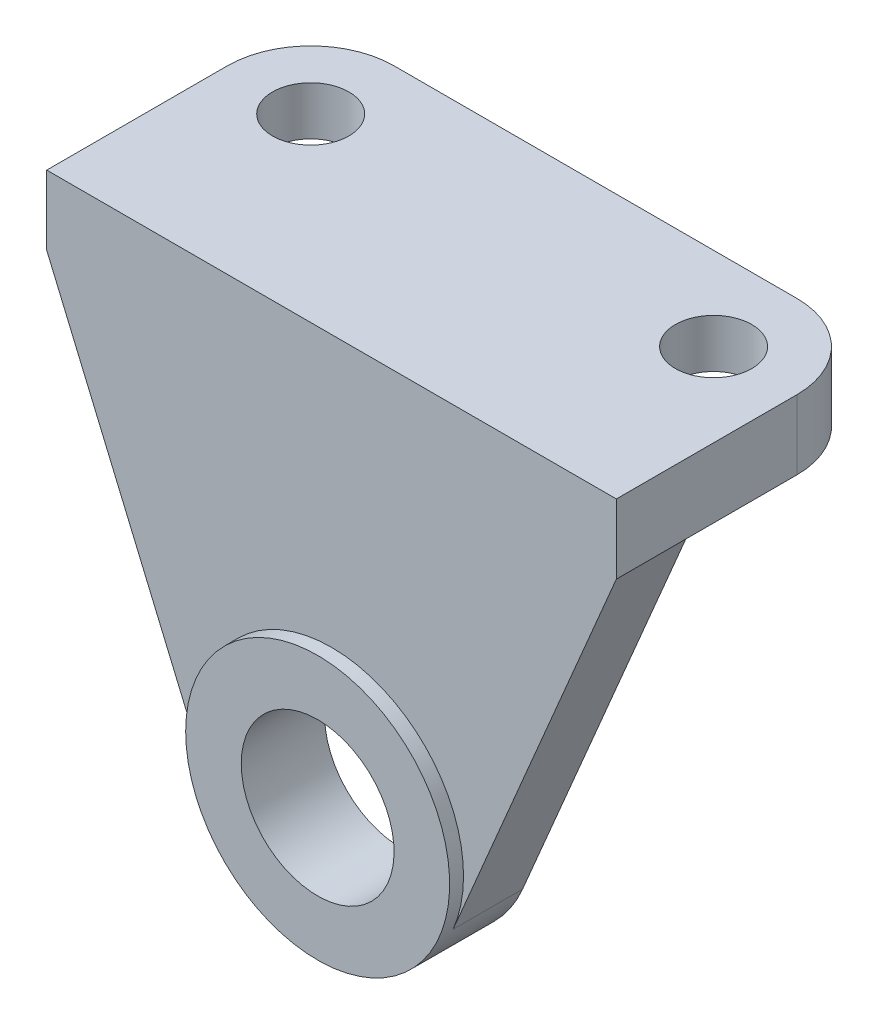
ISO-10303-21;
HEADER;
FILE_DESCRIPTION(('STEP AP214'),'2;1');
FILE_NAME('part.step','',(''),(''),'','','');
FILE_SCHEMA(('AUTOMOTIVE_DESIGN { 1 0 10303 214 1 1 1 1 }'));
ENDSEC;
DATA;
#1=APPLICATION_CONTEXT('core data for automotive mechanical design processes');
#2=APPLICATION_PROTOCOL_DEFINITION('international standard','automotive_design',2000,#1);
#3=PRODUCT_CONTEXT('',#1,'mechanical');
#4=PRODUCT('Part','Part','',(#3));
#5=PRODUCT_RELATED_PRODUCT_CATEGORY('part','',(#4));
#6=PRODUCT_DEFINITION_FORMATION('','',#4);
#7=PRODUCT_DEFINITION_CONTEXT('part definition',#1,'design');
#8=PRODUCT_DEFINITION('design','',#6,#7);
#9=PRODUCT_DEFINITION_SHAPE('','',#8);
#10=(LENGTH_UNIT() NAMED_UNIT(*) SI_UNIT(.MILLI.,.METRE.));
#11=(NAMED_UNIT(*) PLANE_ANGLE_UNIT() SI_UNIT($,.RADIAN.));
#12=(NAMED_UNIT(*) SI_UNIT($,.STERADIAN.) SOLID_ANGLE_UNIT());
#13=UNCERTAINTY_MEASURE_WITH_UNIT(LENGTH_MEASURE(1.E-05),#10,'distance_accuracy_value','');
#14=(GEOMETRIC_REPRESENTATION_CONTEXT(3) GLOBAL_UNCERTAINTY_ASSIGNED_CONTEXT((#13)) GLOBAL_UNIT_ASSIGNED_CONTEXT((#10,
#11,#12)) REPRESENTATION_CONTEXT('',''));
#15=CARTESIAN_POINT('',(0.,0.,0.));
#16=DIRECTION('',(0.,0.,1.));
#17=DIRECTION('',(1.,0.,0.));
#18=AXIS2_PLACEMENT_3D('',#15,#16,#17);
#19=CARTESIAN_POINT('',(82.,67.,-12.));
#20=DIRECTION('',(0.,0.,1.));
#21=DIRECTION('',(0.,-1.,0.));
#22=AXIS2_PLACEMENT_3D('',#19,#20,#21);
#23=PLANE('',#22);
#24=CARTESIAN_POINT('',(41.,19.,-12.));
#25=DIRECTION('',(0.,0.,-1.));
#26=DIRECTION('',(0.,1.,0.));
#27=AXIS2_PLACEMENT_3D('',#24,#25,#26);
#28=CIRCLE('',#27,11.);
#29=CARTESIAN_POINT('',(41.,30.,-12.));
#30=VERTEX_POINT('',#29);
#31=EDGE_CURVE('E141',#30,#30,#28,.T.);
#32=ORIENTED_EDGE('',*,*,#31,.F.);
#33=EDGE_LOOP('',(#32));
#34=FACE_BOUND('',#33,.T.);
#35=CARTESIAN_POINT('',(41.,19.,-12.));
#36=DIRECTION('',(0.,0.,-1.));
#37=DIRECTION('',(0.,1.,0.));
#38=AXIS2_PLACEMENT_3D('',#35,#36,#37);
#39=CIRCLE('',#38,19.);
#40=CARTESIAN_POINT('',(23.5086331219245,11.5802907916439,-12.));
#41=VERTEX_POINT('',#40);
#42=CARTESIAN_POINT('',(58.4913668780754,11.5802907916439,-12.));
#43=VERTEX_POINT('',#42);
#44=EDGE_CURVE('E155',#41,#43,#39,.F.);
#45=ORIENTED_EDGE('',*,*,#44,.F.);
#46=DIRECTION('',(0.390511010966112,-0.920598256740814,0.));
#47=VECTOR('',#46,1.);
#48=CARTESIAN_POINT('',(24.0867516475442,10.2174229289469,-12.));
#49=LINE('',#48,#47);
#50=CARTESIAN_POINT('',(0.,67.,-12.));
#51=VERTEX_POINT('',#50);
#52=EDGE_CURVE('E211',#51,#41,#49,.T.);
#53=ORIENTED_EDGE('',*,*,#52,.F.);
#54=DIRECTION('',(-1.,0.,0.));
#55=VECTOR('',#54,1.);
#56=CARTESIAN_POINT('',(82.,67.,-12.));
#57=LINE('',#56,#55);
#58=CARTESIAN_POINT('',(82.,67.,-12.));
#59=VERTEX_POINT('',#58);
#60=EDGE_CURVE('E193',#59,#51,#57,.T.);
#61=ORIENTED_EDGE('',*,*,#60,.F.);
#62=DIRECTION('',(0.390511010966112,0.920598256740814,0.));
#63=VECTOR('',#62,1.);
#64=CARTESIAN_POINT('',(45.4083426782223,-19.2618850575997,-12.));
#65=LINE('',#64,#63);
#66=EDGE_CURVE('E158',#43,#59,#65,.T.);
#67=ORIENTED_EDGE('',*,*,#66,.F.);
#68=EDGE_LOOP('',(#45,#53,#61,#67));
#69=FACE_BOUND('',#68,.T.);
#70=ADVANCED_FACE('F57',(#34,#69),#23,.F.);
#71=CARTESIAN_POINT('',(82.,0.,0.));
#72=DIRECTION('',(0.,0.,-1.));
#73=DIRECTION('',(-1.,0.,0.));
#74=AXIS2_PLACEMENT_3D('',#71,#72,#73);
#75=PLANE('',#74);
#76=CARTESIAN_POINT('',(41.,19.,0.));
#77=DIRECTION('',(0.,0.,-1.));
#78=DIRECTION('',(-1.,0.,0.));
#79=AXIS2_PLACEMENT_3D('',#76,#77,#78);
#80=CIRCLE('',#79,11.);
#81=CARTESIAN_POINT('',(30.,19.,0.));
#82=VERTEX_POINT('',#81);
#83=EDGE_CURVE('E207',#82,#82,#80,.T.);
#84=ORIENTED_EDGE('',*,*,#83,.T.);
#85=EDGE_LOOP('',(#84));
#86=FACE_BOUND('',#85,.T.);
#87=CARTESIAN_POINT('',(41.,19.,0.));
#88=DIRECTION('',(0.,0.,-1.));
#89=DIRECTION('',(-1.,0.,0.));
#90=AXIS2_PLACEMENT_3D('',#87,#88,#89);
#91=CIRCLE('',#90,19.);
#92=CARTESIAN_POINT('',(22.,19.,0.));
#93=VERTEX_POINT('',#92);
#94=EDGE_CURVE('E199',#93,#93,#91,.F.);
#95=ORIENTED_EDGE('',*,*,#94,.T.);
#96=EDGE_LOOP('',(#95));
#97=FACE_BOUND('',#96,.T.);
#98=ADVANCED_FACE('F314',(#86,#97),#75,.F.);
#99=CARTESIAN_POINT('',(82.,67.,-40.));
#100=DIRECTION('',(0.,1.,0.));
#101=DIRECTION('',(0.,0.,1.));
#102=AXIS2_PLACEMENT_3D('',#99,#100,#101);
#103=PLANE('',#102);
#104=CARTESIAN_POINT('',(12.,67.,-28.));
#105=DIRECTION('',(0.,-1.,0.));
#106=DIRECTION('',(0.,0.,-1.));
#107=AXIS2_PLACEMENT_3D('',#104,#105,#106);
#108=CIRCLE('',#107,10.);
#109=CARTESIAN_POINT('',(12.,67.,-38.));
#110=VERTEX_POINT('',#109);
#111=EDGE_CURVE('E254',#110,#110,#108,.T.);
#112=ORIENTED_EDGE('',*,*,#111,.F.);
#113=EDGE_LOOP('',(#112));
#114=FACE_BOUND('',#113,.T.);
#115=CARTESIAN_POINT('',(70.,67.,-28.));
#116=DIRECTION('',(0.,-1.,0.));
#117=DIRECTION('',(0.,0.,-1.));
#118=AXIS2_PLACEMENT_3D('',#115,#116,#117);
#119=CIRCLE('',#118,9.99999999999999);
#120=CARTESIAN_POINT('',(70.,67.,-38.));
#121=VERTEX_POINT('',#120);
#122=EDGE_CURVE('E241',#121,#121,#119,.T.);
#123=ORIENTED_EDGE('',*,*,#122,.F.);
#124=EDGE_LOOP('',(#123));
#125=FACE_BOUND('',#124,.T.);
#126=DIRECTION('',(-1.,0.,0.));
#127=VECTOR('',#126,1.);
#128=CARTESIAN_POINT('',(82.,67.,-40.));
#129=LINE('',#128,#127);
#130=CARTESIAN_POINT('',(70.,67.,-40.));
#131=VERTEX_POINT('',#130);
#132=CARTESIAN_POINT('',(12.,67.,-40.));
#133=VERTEX_POINT('',#132);
#134=EDGE_CURVE('E190',#131,#133,#129,.T.);
#135=ORIENTED_EDGE('',*,*,#134,.F.);
#136=CARTESIAN_POINT('',(70.,67.,-28.));
#137=DIRECTION('',(0.,1.,0.));
#138=DIRECTION('',(0.,0.,1.));
#139=AXIS2_PLACEMENT_3D('',#136,#137,#138);
#140=CIRCLE('',#139,12.);
#141=CARTESIAN_POINT('',(82.,67.,-28.));
#142=VERTEX_POINT('',#141);
#143=EDGE_CURVE('E12',#131,#142,#140,.F.);
#144=ORIENTED_EDGE('',*,*,#143,.T.);
#145=DIRECTION('',(0.,0.,-1.));
#146=VECTOR('',#145,1.);
#147=CARTESIAN_POINT('',(82.,67.,-40.));
#148=LINE('',#147,#146);
#149=EDGE_CURVE('E164',#59,#142,#148,.T.);
#150=ORIENTED_EDGE('',*,*,#149,.F.);
#151=ORIENTED_EDGE('',*,*,#60,.T.);
#152=DIRECTION('',(0.,0.,-1.));
#153=VECTOR('',#152,1.);
#154=CARTESIAN_POINT('',(0.,67.,-40.));
#155=LINE('',#154,#153);
#156=CARTESIAN_POINT('',(0.,67.,-28.));
#157=VERTEX_POINT('',#156);
#158=EDGE_CURVE('E151',#51,#157,#155,.T.);
#159=ORIENTED_EDGE('',*,*,#158,.T.);
#160=CARTESIAN_POINT('',(12.,67.,-28.));
#161=DIRECTION('',(0.,1.,0.));
#162=DIRECTION('',(0.,0.,1.));
#163=AXIS2_PLACEMENT_3D('',#160,#161,#162);
#164=CIRCLE('',#163,12.);
#165=EDGE_CURVE('E221',#157,#133,#164,.F.);
#166=ORIENTED_EDGE('',*,*,#165,.T.);
#167=EDGE_LOOP('',(#135,#144,#150,#151,#159,#166));
#168=FACE_BOUND('',#167,.T.);
#169=ADVANCED_FACE('F296',(#114,#125,#168),#103,.F.);
#170=CARTESIAN_POINT('',(82.,77.,-40.));
#171=DIRECTION('',(0.,0.,1.));
#172=DIRECTION('',(1.,0.,0.));
#173=AXIS2_PLACEMENT_3D('',#170,#171,#172);
#174=PLANE('',#173);
#175=DIRECTION('',(-1.,0.,0.));
#176=VECTOR('',#175,1.);
#177=CARTESIAN_POINT('',(82.,77.,-40.));
#178=LINE('',#177,#176);
#179=CARTESIAN_POINT('',(70.,77.,-40.));
#180=VERTEX_POINT('',#179);
#181=CARTESIAN_POINT('',(12.,77.,-40.));
#182=VERTEX_POINT('',#181);
#183=EDGE_CURVE('E187',#180,#182,#178,.T.);
#184=ORIENTED_EDGE('',*,*,#183,.F.);
#185=DIRECTION('',(0.,1.,0.));
#186=VECTOR('',#185,1.);
#187=CARTESIAN_POINT('',(70.,77.,-40.));
#188=LINE('',#187,#186);
#189=EDGE_CURVE('E67',#180,#131,#188,.F.);
#190=ORIENTED_EDGE('',*,*,#189,.T.);
#191=ORIENTED_EDGE('',*,*,#134,.T.);
#192=DIRECTION('',(0.,1.,0.));
#193=VECTOR('',#192,1.);
#194=CARTESIAN_POINT('',(12.,77.,-40.));
#195=LINE('',#194,#193);
#196=EDGE_CURVE('E206',#133,#182,#195,.T.);
#197=ORIENTED_EDGE('',*,*,#196,.T.);
#198=EDGE_LOOP('',(#184,#190,#191,#197));
#199=FACE_BOUND('',#198,.T.);
#200=ADVANCED_FACE('F326',(#199),#174,.F.);
#201=CARTESIAN_POINT('',(82.,77.,-2.));
#202=DIRECTION('',(0.,-1.,0.));
#203=DIRECTION('',(0.,0.,-1.));
#204=AXIS2_PLACEMENT_3D('',#201,#202,#203);
#205=PLANE('',#204);
#206=CARTESIAN_POINT('',(12.,77.,-28.));
#207=DIRECTION('',(0.,-1.,0.));
#208=DIRECTION('',(0.,0.,-1.));
#209=AXIS2_PLACEMENT_3D('',#206,#207,#208);
#210=CIRCLE('',#209,5.5);
#211=CARTESIAN_POINT('',(12.,77.,-33.5));
#212=VERTEX_POINT('',#211);
#213=EDGE_CURVE('E235',#212,#212,#210,.T.);
#214=ORIENTED_EDGE('',*,*,#213,.T.);
#215=EDGE_LOOP('',(#214));
#216=FACE_BOUND('',#215,.T.);
#217=CARTESIAN_POINT('',(70.,77.,-28.));
#218=DIRECTION('',(0.,-1.,0.));
#219=DIRECTION('',(0.,0.,-1.));
#220=AXIS2_PLACEMENT_3D('',#217,#218,#219);
#221=CIRCLE('',#220,5.5);
#222=CARTESIAN_POINT('',(70.,77.,-33.5));
#223=VERTEX_POINT('',#222);
#224=EDGE_CURVE('E243',#223,#223,#221,.T.);
#225=ORIENTED_EDGE('',*,*,#224,.T.);
#226=EDGE_LOOP('',(#225));
#227=FACE_BOUND('',#226,.T.);
#228=DIRECTION('',(0.,0.,1.));
#229=VECTOR('',#228,1.);
#230=CARTESIAN_POINT('',(82.,77.,-2.));
#231=LINE('',#230,#229);
#232=CARTESIAN_POINT('',(82.,77.,-28.));
#233=VERTEX_POINT('',#232);
#234=CARTESIAN_POINT('',(82.,77.,-2.));
#235=VERTEX_POINT('',#234);
#236=EDGE_CURVE('E168',#233,#235,#231,.T.);
#237=ORIENTED_EDGE('',*,*,#236,.F.);
#238=CARTESIAN_POINT('',(70.,77.,-28.));
#239=DIRECTION('',(0.,-1.,0.));
#240=DIRECTION('',(0.,0.,-1.));
#241=AXIS2_PLACEMENT_3D('',#238,#239,#240);
#242=CIRCLE('',#241,12.);
#243=EDGE_CURVE('E82',#233,#180,#242,.F.);
#244=ORIENTED_EDGE('',*,*,#243,.T.);
#245=ORIENTED_EDGE('',*,*,#183,.T.);
#246=CARTESIAN_POINT('',(12.,77.,-28.));
#247=DIRECTION('',(0.,-1.,0.));
#248=DIRECTION('',(0.,0.,-1.));
#249=AXIS2_PLACEMENT_3D('',#246,#247,#248);
#250=CIRCLE('',#249,12.);
#251=CARTESIAN_POINT('',(0.,77.,-28.));
#252=VERTEX_POINT('',#251);
#253=EDGE_CURVE('E215',#182,#252,#250,.F.);
#254=ORIENTED_EDGE('',*,*,#253,.T.);
#255=DIRECTION('',(0.,0.,1.));
#256=VECTOR('',#255,1.);
#257=CARTESIAN_POINT('',(0.,77.,-2.));
#258=LINE('',#257,#256);
#259=CARTESIAN_POINT('',(0.,77.,-2.));
#260=VERTEX_POINT('',#259);
#261=EDGE_CURVE('E179',#252,#260,#258,.T.);
#262=ORIENTED_EDGE('',*,*,#261,.T.);
#263=DIRECTION('',(-1.,0.,0.));
#264=VECTOR('',#263,1.);
#265=CARTESIAN_POINT('',(82.,77.,-2.));
#266=LINE('',#265,#264);
#267=EDGE_CURVE('E175',#235,#260,#266,.T.);
#268=ORIENTED_EDGE('',*,*,#267,.F.);
#269=EDGE_LOOP('',(#237,#244,#245,#254,#262,#268));
#270=FACE_BOUND('',#269,.T.);
#271=ADVANCED_FACE('F288',(#216,#227,#270),#205,.F.);
#272=CARTESIAN_POINT('',(82.,38.,-2.));
#273=DIRECTION('',(0.,0.,-1.));
#274=DIRECTION('',(0.,1.,0.));
#275=AXIS2_PLACEMENT_3D('',#272,#273,#274);
#276=PLANE('',#275);
#277=DIRECTION('',(0.,-1.,0.));
#278=VECTOR('',#277,1.);
#279=CARTESIAN_POINT('',(0.,38.,-2.));
#280=LINE('',#279,#278);
#281=CARTESIAN_POINT('',(0.,67.,-2.));
#282=VERTEX_POINT('',#281);
#283=EDGE_CURVE('E169',#260,#282,#280,.T.);
#284=ORIENTED_EDGE('',*,*,#283,.T.);
#285=DIRECTION('',(0.390511010966112,-0.920598256740814,0.));
#286=VECTOR('',#285,1.);
#287=CARTESIAN_POINT('',(22.9305145963049,12.9431586543408,-2.));
#288=LINE('',#287,#286);
#289=CARTESIAN_POINT('',(23.5086331219245,11.5802907916439,-2.));
#290=VERTEX_POINT('',#289);
#291=EDGE_CURVE('E136',#282,#290,#288,.T.);
#292=ORIENTED_EDGE('',*,*,#291,.T.);
#293=CARTESIAN_POINT('',(41.,19.,-1.99999999999999));
#294=DIRECTION('',(0.,0.,-1.));
#295=DIRECTION('',(0.,1.,0.));
#296=AXIS2_PLACEMENT_3D('',#293,#294,#295);
#297=CIRCLE('',#296,19.);
#298=CARTESIAN_POINT('',(58.4913668780754,11.5802907916439,-1.99999999999999));
#299=VERTEX_POINT('',#298);
#300=EDGE_CURVE('E129',#290,#299,#297,.T.);
#301=ORIENTED_EDGE('',*,*,#300,.T.);
#302=DIRECTION('',(0.390511010966112,0.920598256740814,0.));
#303=VECTOR('',#302,1.);
#304=CARTESIAN_POINT('',(71.5743910779286,42.4224666408875,-2.));
#305=LINE('',#304,#303);
#306=CARTESIAN_POINT('',(82.,67.,-2.));
#307=VERTEX_POINT('',#306);
#308=EDGE_CURVE('E134',#299,#307,#305,.T.);
#309=ORIENTED_EDGE('',*,*,#308,.T.);
#310=DIRECTION('',(0.,-1.,0.));
#311=VECTOR('',#310,1.);
#312=CARTESIAN_POINT('',(82.,38.,-2.));
#313=LINE('',#312,#311);
#314=EDGE_CURVE('E172',#235,#307,#313,.T.);
#315=ORIENTED_EDGE('',*,*,#314,.F.);
#316=ORIENTED_EDGE('',*,*,#267,.T.);
#317=EDGE_LOOP('',(#284,#292,#301,#309,#315,#316));
#318=FACE_BOUND('',#317,.T.);
#319=ADVANCED_FACE('F132',(#318),#276,.F.);
#320=CARTESIAN_POINT('',(82.,0.,0.));
#321=DIRECTION('',(-1.,0.,0.));
#322=DIRECTION('',(0.,0.,1.));
#323=AXIS2_PLACEMENT_3D('',#320,#321,#322);
#324=PLANE('',#323);
#325=ORIENTED_EDGE('',*,*,#149,.T.);
#326=DIRECTION('',(0.,1.,0.));
#327=VECTOR('',#326,1.);
#328=CARTESIAN_POINT('',(82.,0.,-28.));
#329=LINE('',#328,#327);
#330=EDGE_CURVE('E225',#142,#233,#329,.T.);
#331=ORIENTED_EDGE('',*,*,#330,.T.);
#332=ORIENTED_EDGE('',*,*,#236,.T.);
#333=ORIENTED_EDGE('',*,*,#314,.T.);
#334=DIRECTION('',(0.,0.,-1.));
#335=VECTOR('',#334,1.);
#336=CARTESIAN_POINT('',(82.,67.,0.));
#337=LINE('',#336,#335);
#338=EDGE_CURVE('E149',#307,#59,#337,.T.);
#339=ORIENTED_EDGE('',*,*,#338,.T.);
#340=EDGE_LOOP('',(#325,#331,#332,#333,#339));
#341=FACE_BOUND('',#340,.T.);
#342=ADVANCED_FACE('F301',(#341),#324,.F.);
#343=CARTESIAN_POINT('',(0.,0.,0.));
#344=DIRECTION('',(-1.,0.,0.));
#345=DIRECTION('',(0.,0.,1.));
#346=AXIS2_PLACEMENT_3D('',#343,#344,#345);
#347=PLANE('',#346);
#348=ORIENTED_EDGE('',*,*,#261,.F.);
#349=DIRECTION('',(0.,1.,0.));
#350=VECTOR('',#349,1.);
#351=CARTESIAN_POINT('',(0.,67.,-28.));
#352=LINE('',#351,#350);
#353=EDGE_CURVE('E218',#252,#157,#352,.F.);
#354=ORIENTED_EDGE('',*,*,#353,.T.);
#355=ORIENTED_EDGE('',*,*,#158,.F.);
#356=DIRECTION('',(0.,0.,-1.));
#357=VECTOR('',#356,1.);
#358=CARTESIAN_POINT('',(0.,67.,0.));
#359=LINE('',#358,#357);
#360=EDGE_CURVE('E203',#282,#51,#359,.T.);
#361=ORIENTED_EDGE('',*,*,#360,.F.);
#362=ORIENTED_EDGE('',*,*,#283,.F.);
#363=EDGE_LOOP('',(#348,#354,#355,#361,#362));
#364=FACE_BOUND('',#363,.T.);
#365=ADVANCED_FACE('F286',(#364),#347,.T.);
#366=CARTESIAN_POINT('',(41.,19.,70.));
#367=DIRECTION('',(0.,0.,-1.));
#368=DIRECTION('',(0.,1.,0.));
#369=AXIS2_PLACEMENT_3D('',#366,#367,#368);
#370=CYLINDRICAL_SURFACE('',#369,19.);
#371=ORIENTED_EDGE('',*,*,#94,.F.);
#372=EDGE_LOOP('',(#371));
#373=FACE_BOUND('',#372,.T.);
#374=DIRECTION('',(0.,0.,-1.));
#375=VECTOR('',#374,1.);
#376=CARTESIAN_POINT('',(58.4913668780754,11.5802907916439,70.));
#377=LINE('',#376,#375);
#378=EDGE_CURVE('E146',#299,#43,#377,.T.);
#379=ORIENTED_EDGE('',*,*,#378,.F.);
#380=ORIENTED_EDGE('',*,*,#300,.F.);
#381=DIRECTION('',(0.,0.,-1.));
#382=VECTOR('',#381,1.);
#383=CARTESIAN_POINT('',(23.5086331219245,11.5802907916439,70.));
#384=LINE('',#383,#382);
#385=EDGE_CURVE('E271',#290,#41,#384,.T.);
#386=ORIENTED_EDGE('',*,*,#385,.T.);
#387=ORIENTED_EDGE('',*,*,#44,.T.);
#388=EDGE_LOOP('',(#379,#380,#386,#387));
#389=FACE_BOUND('',#388,.T.);
#390=ADVANCED_FACE('F153',(#373,#389),#370,.T.);
#391=CARTESIAN_POINT('',(45.4083426782223,-19.2618850575997,70.));
#392=DIRECTION('',(-0.920598256740814,0.390511010966112,0.));
#393=DIRECTION('',(-0.390511010966112,-0.920598256740814,0.));
#394=AXIS2_PLACEMENT_3D('',#391,#392,#393);
#395=PLANE('',#394);
#396=ORIENTED_EDGE('',*,*,#308,.F.);
#397=ORIENTED_EDGE('',*,*,#378,.T.);
#398=ORIENTED_EDGE('',*,*,#66,.T.);
#399=ORIENTED_EDGE('',*,*,#338,.F.);
#400=EDGE_LOOP('',(#396,#397,#398,#399));
#401=FACE_BOUND('',#400,.T.);
#402=ADVANCED_FACE('F145',(#401),#395,.F.);
#403=CARTESIAN_POINT('',(24.0867516475442,10.2174229289469,70.));
#404=DIRECTION('',(0.920598256740814,0.390511010966112,0.));
#405=DIRECTION('',(-0.390511010966112,0.920598256740814,0.));
#406=AXIS2_PLACEMENT_3D('',#403,#404,#405);
#407=PLANE('',#406);
#408=ORIENTED_EDGE('',*,*,#385,.F.);
#409=ORIENTED_EDGE('',*,*,#291,.F.);
#410=ORIENTED_EDGE('',*,*,#360,.T.);
#411=ORIENTED_EDGE('',*,*,#52,.T.);
#412=EDGE_LOOP('',(#408,#409,#410,#411));
#413=FACE_BOUND('',#412,.T.);
#414=ADVANCED_FACE('F280',(#413),#407,.F.);
#415=CARTESIAN_POINT('',(41.,19.,70.));
#416=DIRECTION('',(0.,0.,-1.));
#417=DIRECTION('',(0.,1.,0.));
#418=AXIS2_PLACEMENT_3D('',#415,#416,#417);
#419=CYLINDRICAL_SURFACE('',#418,11.);
#420=ORIENTED_EDGE('',*,*,#31,.T.);
#421=EDGE_LOOP('',(#420));
#422=FACE_BOUND('',#421,.T.);
#423=ORIENTED_EDGE('',*,*,#83,.F.);
#424=EDGE_LOOP('',(#423));
#425=FACE_BOUND('',#424,.T.);
#426=ADVANCED_FACE('F312',(#422,#425),#419,.F.);
#427=CARTESIAN_POINT('',(12.,77.,-28.));
#428=DIRECTION('',(0.,-1.,0.));
#429=DIRECTION('',(0.,0.,-1.));
#430=AXIS2_PLACEMENT_3D('',#427,#428,#429);
#431=CYLINDRICAL_SURFACE('',#430,12.);
#432=ORIENTED_EDGE('',*,*,#165,.F.);
#433=ORIENTED_EDGE('',*,*,#353,.F.);
#434=ORIENTED_EDGE('',*,*,#253,.F.);
#435=ORIENTED_EDGE('',*,*,#196,.F.);
#436=EDGE_LOOP('',(#432,#433,#434,#435));
#437=FACE_BOUND('',#436,.T.);
#438=ADVANCED_FACE('F293',(#437),#431,.T.);
#439=CARTESIAN_POINT('',(70.,0.,-28.));
#440=DIRECTION('',(0.,1.,0.));
#441=DIRECTION('',(0.,0.,1.));
#442=AXIS2_PLACEMENT_3D('',#439,#440,#441);
#443=CYLINDRICAL_SURFACE('',#442,12.);
#444=ORIENTED_EDGE('',*,*,#143,.F.);
#445=ORIENTED_EDGE('',*,*,#189,.F.);
#446=ORIENTED_EDGE('',*,*,#243,.F.);
#447=ORIENTED_EDGE('',*,*,#330,.F.);
#448=EDGE_LOOP('',(#444,#445,#446,#447));
#449=FACE_BOUND('',#448,.T.);
#450=ADVANCED_FACE('F59',(#449),#443,.T.);
#451=CARTESIAN_POINT('',(70.,70.,-28.));
#452=DIRECTION('',(0.,-1.,0.));
#453=DIRECTION('',(0.,0.,-1.));
#454=AXIS2_PLACEMENT_3D('',#451,#452,#453);
#455=CYLINDRICAL_SURFACE('',#454,9.99999999999999);
#456=CARTESIAN_POINT('',(70.,70.,-28.));
#457=DIRECTION('',(0.,-1.,0.));
#458=DIRECTION('',(0.,0.,-1.));
#459=AXIS2_PLACEMENT_3D('',#456,#457,#458);
#460=CIRCLE('',#459,9.99999999999999);
#461=CARTESIAN_POINT('',(70.,70.,-38.));
#462=VERTEX_POINT('',#461);
#463=EDGE_CURVE('E258',#462,#462,#460,.T.);
#464=ORIENTED_EDGE('',*,*,#463,.F.);
#465=EDGE_LOOP('',(#464));
#466=FACE_BOUND('',#465,.T.);
#467=ORIENTED_EDGE('',*,*,#122,.T.);
#468=EDGE_LOOP('',(#467));
#469=FACE_BOUND('',#468,.T.);
#470=ADVANCED_FACE('F304',(#466,#469),#455,.F.);
#471=CARTESIAN_POINT('',(70.,70.,-28.));
#472=DIRECTION('',(0.,-1.,0.));
#473=DIRECTION('',(0.,0.,-1.));
#474=AXIS2_PLACEMENT_3D('',#471,#472,#473);
#475=PLANE('',#474);
#476=CARTESIAN_POINT('',(70.,70.,-28.));
#477=DIRECTION('',(0.,-1.,0.));
#478=DIRECTION('',(0.,0.,-1.));
#479=AXIS2_PLACEMENT_3D('',#476,#477,#478);
#480=CIRCLE('',#479,5.5);
#481=CARTESIAN_POINT('',(70.,70.,-33.5));
#482=VERTEX_POINT('',#481);
#483=EDGE_CURVE('E61',#482,#482,#480,.T.);
#484=ORIENTED_EDGE('',*,*,#483,.F.);
#485=EDGE_LOOP('',(#484));
#486=FACE_BOUND('',#485,.T.);
#487=ORIENTED_EDGE('',*,*,#463,.T.);
#488=EDGE_LOOP('',(#487));
#489=FACE_BOUND('',#488,.T.);
#490=ADVANCED_FACE('F309',(#486,#489),#475,.T.);
#491=CARTESIAN_POINT('',(12.,70.,-28.));
#492=DIRECTION('',(0.,-1.,0.));
#493=DIRECTION('',(0.,0.,-1.));
#494=AXIS2_PLACEMENT_3D('',#491,#492,#493);
#495=CYLINDRICAL_SURFACE('',#494,10.);
#496=CARTESIAN_POINT('',(12.,70.,-28.));
#497=DIRECTION('',(0.,-1.,0.));
#498=DIRECTION('',(0.,0.,-1.));
#499=AXIS2_PLACEMENT_3D('',#496,#497,#498);
#500=CIRCLE('',#499,10.);
#501=CARTESIAN_POINT('',(12.,70.,-38.));
#502=VERTEX_POINT('',#501);
#503=EDGE_CURVE('E142',#502,#502,#500,.T.);
#504=ORIENTED_EDGE('',*,*,#503,.F.);
#505=EDGE_LOOP('',(#504));
#506=FACE_BOUND('',#505,.T.);
#507=ORIENTED_EDGE('',*,*,#111,.T.);
#508=EDGE_LOOP('',(#507));
#509=FACE_BOUND('',#508,.T.);
#510=ADVANCED_FACE('F350',(#506,#509),#495,.F.);
#511=CARTESIAN_POINT('',(12.,70.,-28.));
#512=DIRECTION('',(0.,-1.,0.));
#513=DIRECTION('',(0.,0.,-1.));
#514=AXIS2_PLACEMENT_3D('',#511,#512,#513);
#515=PLANE('',#514);
#516=CARTESIAN_POINT('',(12.,70.,-28.));
#517=DIRECTION('',(0.,-1.,0.));
#518=DIRECTION('',(0.,0.,-1.));
#519=AXIS2_PLACEMENT_3D('',#516,#517,#518);
#520=CIRCLE('',#519,5.5);
#521=CARTESIAN_POINT('',(12.,70.,-33.5));
#522=VERTEX_POINT('',#521);
#523=EDGE_CURVE('E232',#522,#522,#520,.T.);
#524=ORIENTED_EDGE('',*,*,#523,.F.);
#525=EDGE_LOOP('',(#524));
#526=FACE_BOUND('',#525,.T.);
#527=ORIENTED_EDGE('',*,*,#503,.T.);
#528=EDGE_LOOP('',(#527));
#529=FACE_BOUND('',#528,.T.);
#530=ADVANCED_FACE('F354',(#526,#529),#515,.T.);
#531=CARTESIAN_POINT('',(12.,77.,-28.));
#532=DIRECTION('',(0.,-1.,0.));
#533=DIRECTION('',(0.,0.,-1.));
#534=AXIS2_PLACEMENT_3D('',#531,#532,#533);
#535=CYLINDRICAL_SURFACE('',#534,5.5);
#536=ORIENTED_EDGE('',*,*,#523,.T.);
#537=EDGE_LOOP('',(#536));
#538=FACE_BOUND('',#537,.T.);
#539=ORIENTED_EDGE('',*,*,#213,.F.);
#540=EDGE_LOOP('',(#539));
#541=FACE_BOUND('',#540,.T.);
#542=ADVANCED_FACE('F358',(#538,#541),#535,.F.);
#543=CARTESIAN_POINT('',(70.,77.,-28.));
#544=DIRECTION('',(0.,-1.,0.));
#545=DIRECTION('',(0.,0.,-1.));
#546=AXIS2_PLACEMENT_3D('',#543,#544,#545);
#547=CYLINDRICAL_SURFACE('',#546,5.5);
#548=ORIENTED_EDGE('',*,*,#483,.T.);
#549=EDGE_LOOP('',(#548));
#550=FACE_BOUND('',#549,.T.);
#551=ORIENTED_EDGE('',*,*,#224,.F.);
#552=EDGE_LOOP('',(#551));
#553=FACE_BOUND('',#552,.T.);
#554=ADVANCED_FACE('F360',(#550,#553),#547,.F.);
#555=CLOSED_SHELL('',(#70,#98,#169,#200,#271,#319,#342,#365,#390,#402,#414,#426,#438,#450,#470,
#490,#510,#530,#542,#554));
#556=MANIFOLD_SOLID_BREP('B2',#555);
#557=ADVANCED_BREP_SHAPE_REPRESENTATION('',(#18,#556),#14);
#558=SHAPE_DEFINITION_REPRESENTATION(#9,#557);
ENDSEC;
END-ISO-10303-21;
